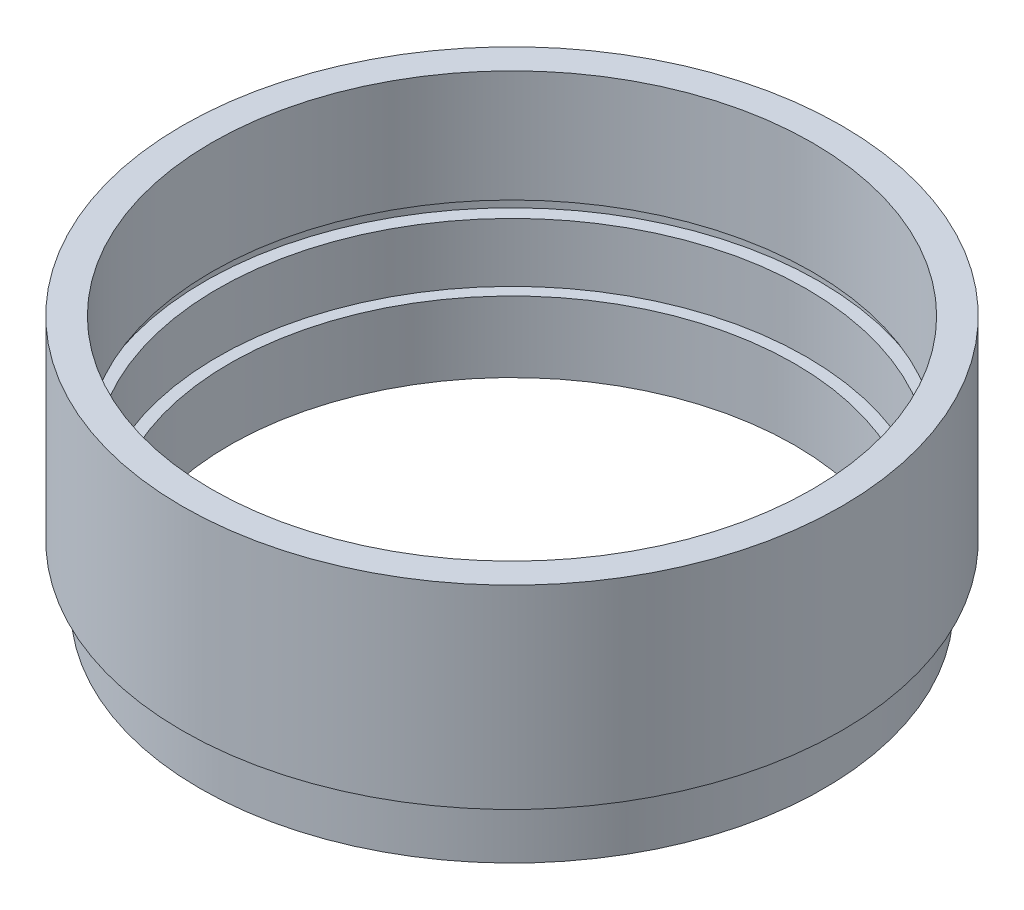
ISO-10303-21;
HEADER;
FILE_DESCRIPTION(('STEP AP214'),'2;1');
FILE_NAME('part.step','',(''),(''),'','','');
FILE_SCHEMA(('AUTOMOTIVE_DESIGN { 1 0 10303 214 1 1 1 1 }'));
ENDSEC;
DATA;
#1=APPLICATION_CONTEXT('core data for automotive mechanical design processes');
#2=APPLICATION_PROTOCOL_DEFINITION('international standard','automotive_design',2000,#1);
#3=PRODUCT_CONTEXT('',#1,'mechanical');
#4=PRODUCT('Part','Part','',(#3));
#5=PRODUCT_RELATED_PRODUCT_CATEGORY('part','',(#4));
#6=PRODUCT_DEFINITION_FORMATION('','',#4);
#7=PRODUCT_DEFINITION_CONTEXT('part definition',#1,'design');
#8=PRODUCT_DEFINITION('design','',#6,#7);
#9=PRODUCT_DEFINITION_SHAPE('','',#8);
#10=(LENGTH_UNIT() NAMED_UNIT(*) SI_UNIT(.MILLI.,.METRE.));
#11=(NAMED_UNIT(*) PLANE_ANGLE_UNIT() SI_UNIT($,.RADIAN.));
#12=(NAMED_UNIT(*) SI_UNIT($,.STERADIAN.) SOLID_ANGLE_UNIT());
#13=UNCERTAINTY_MEASURE_WITH_UNIT(LENGTH_MEASURE(1.E-05),#10,'distance_accuracy_value','');
#14=(GEOMETRIC_REPRESENTATION_CONTEXT(3) GLOBAL_UNCERTAINTY_ASSIGNED_CONTEXT((#13)) GLOBAL_UNIT_ASSIGNED_CONTEXT((#10,
#11,#12)) REPRESENTATION_CONTEXT('',''));
#15=CARTESIAN_POINT('',(0.,0.,0.));
#16=DIRECTION('',(0.,0.,1.));
#17=DIRECTION('',(1.,0.,0.));
#18=AXIS2_PLACEMENT_3D('',#15,#16,#17);
#19=CARTESIAN_POINT('',(0.,0.,0.));
#20=DIRECTION('',(0.,-1.,0.));
#21=DIRECTION('',(0.,0.,-1.));
#22=AXIS2_PLACEMENT_3D('',#19,#20,#21);
#23=CYLINDRICAL_SURFACE('',#22,24.);
#24=CARTESIAN_POINT('',(0.,0.,0.));
#25=DIRECTION('',(0.,-1.,0.));
#26=DIRECTION('',(0.,0.,-1.));
#27=AXIS2_PLACEMENT_3D('',#24,#25,#26);
#28=CIRCLE('',#27,24.);
#29=CARTESIAN_POINT('',(0.,0.,-24.));
#30=VERTEX_POINT('',#29);
#31=EDGE_CURVE('E10',#30,#30,#28,.T.);
#32=ORIENTED_EDGE('',*,*,#31,.T.);
#33=EDGE_LOOP('',(#32));
#34=FACE_BOUND('',#33,.T.);
#35=CARTESIAN_POINT('',(0.,6.,0.));
#36=DIRECTION('',(0.,-1.,0.));
#37=DIRECTION('',(0.,0.,-1.));
#38=AXIS2_PLACEMENT_3D('',#35,#36,#37);
#39=CIRCLE('',#38,24.);
#40=CARTESIAN_POINT('',(0.,6.,-24.));
#41=VERTEX_POINT('',#40);
#42=EDGE_CURVE('E81',#41,#41,#39,.T.);
#43=ORIENTED_EDGE('',*,*,#42,.F.);
#44=EDGE_LOOP('',(#43));
#45=FACE_BOUND('',#44,.T.);
#46=ADVANCED_FACE('F35',(#34,#45),#23,.F.);
#47=CARTESIAN_POINT('',(24.,0.,0.));
#48=DIRECTION('',(0.,-1.,0.));
#49=DIRECTION('',(0.,0.,-1.));
#50=AXIS2_PLACEMENT_3D('',#47,#48,#49);
#51=PLANE('',#50);
#52=CARTESIAN_POINT('',(0.,0.,0.));
#53=DIRECTION('',(0.,-1.,0.));
#54=DIRECTION('',(0.,0.,-1.));
#55=AXIS2_PLACEMENT_3D('',#52,#53,#54);
#56=CIRCLE('',#55,26.5);
#57=CARTESIAN_POINT('',(0.,0.,-26.5));
#58=VERTEX_POINT('',#57);
#59=EDGE_CURVE('E41',#58,#58,#56,.T.);
#60=ORIENTED_EDGE('',*,*,#59,.T.);
#61=EDGE_LOOP('',(#60));
#62=FACE_BOUND('',#61,.T.);
#63=ORIENTED_EDGE('',*,*,#31,.F.);
#64=EDGE_LOOP('',(#63));
#65=FACE_BOUND('',#64,.T.);
#66=ADVANCED_FACE('F89',(#62,#65),#51,.T.);
#67=CARTESIAN_POINT('',(0.,0.,0.));
#68=DIRECTION('',(0.,-1.,0.));
#69=DIRECTION('',(0.,0.,-1.));
#70=AXIS2_PLACEMENT_3D('',#67,#68,#69);
#71=CYLINDRICAL_SURFACE('',#70,26.5);
#72=CARTESIAN_POINT('',(0.,4.,0.));
#73=DIRECTION('',(0.,-1.,0.));
#74=DIRECTION('',(0.,0.,-1.));
#75=AXIS2_PLACEMENT_3D('',#72,#73,#74);
#76=CIRCLE('',#75,26.5);
#77=CARTESIAN_POINT('',(0.,4.,-26.5));
#78=VERTEX_POINT('',#77);
#79=EDGE_CURVE('E45',#78,#78,#76,.T.);
#80=ORIENTED_EDGE('',*,*,#79,.T.);
#81=EDGE_LOOP('',(#80));
#82=FACE_BOUND('',#81,.T.);
#83=ORIENTED_EDGE('',*,*,#59,.F.);
#84=EDGE_LOOP('',(#83));
#85=FACE_BOUND('',#84,.T.);
#86=ADVANCED_FACE('F93',(#82,#85),#71,.T.);
#87=CARTESIAN_POINT('',(26.5,4.,0.));
#88=DIRECTION('',(0.,1.,0.));
#89=DIRECTION('',(0.,0.,1.));
#90=AXIS2_PLACEMENT_3D('',#87,#88,#89);
#91=PLANE('',#90);
#92=CARTESIAN_POINT('',(0.,4.,0.));
#93=DIRECTION('',(0.,-1.,0.));
#94=DIRECTION('',(0.,0.,-1.));
#95=AXIS2_PLACEMENT_3D('',#92,#93,#94);
#96=CIRCLE('',#95,25.5);
#97=CARTESIAN_POINT('',(0.,4.,-25.5));
#98=VERTEX_POINT('',#97);
#99=EDGE_CURVE('E49',#98,#98,#96,.T.);
#100=ORIENTED_EDGE('',*,*,#99,.T.);
#101=EDGE_LOOP('',(#100));
#102=FACE_BOUND('',#101,.T.);
#103=ORIENTED_EDGE('',*,*,#79,.F.);
#104=EDGE_LOOP('',(#103));
#105=FACE_BOUND('',#104,.T.);
#106=ADVANCED_FACE('F97',(#102,#105),#91,.T.);
#107=CARTESIAN_POINT('',(0.,0.,0.));
#108=DIRECTION('',(0.,-1.,0.));
#109=DIRECTION('',(0.,0.,-1.));
#110=AXIS2_PLACEMENT_3D('',#107,#108,#109);
#111=CYLINDRICAL_SURFACE('',#110,25.5);
#112=CARTESIAN_POINT('',(0.,5.,0.));
#113=DIRECTION('',(0.,-1.,0.));
#114=DIRECTION('',(0.,0.,-1.));
#115=AXIS2_PLACEMENT_3D('',#112,#113,#114);
#116=CIRCLE('',#115,25.5);
#117=CARTESIAN_POINT('',(0.,5.,-25.5));
#118=VERTEX_POINT('',#117);
#119=EDGE_CURVE('E54',#118,#118,#116,.T.);
#120=ORIENTED_EDGE('',*,*,#119,.T.);
#121=EDGE_LOOP('',(#120));
#122=FACE_BOUND('',#121,.T.);
#123=ORIENTED_EDGE('',*,*,#99,.F.);
#124=EDGE_LOOP('',(#123));
#125=FACE_BOUND('',#124,.T.);
#126=ADVANCED_FACE('F104',(#122,#125),#111,.T.);
#127=CARTESIAN_POINT('',(25.5,5.,0.));
#128=DIRECTION('',(0.,-1.,0.));
#129=DIRECTION('',(0.,0.,-1.));
#130=AXIS2_PLACEMENT_3D('',#127,#128,#129);
#131=PLANE('',#130);
#132=CARTESIAN_POINT('',(0.,5.,0.));
#133=DIRECTION('',(0.,-1.,0.));
#134=DIRECTION('',(0.,0.,-1.));
#135=AXIS2_PLACEMENT_3D('',#132,#133,#134);
#136=CIRCLE('',#135,28.);
#137=CARTESIAN_POINT('',(0.,5.,-28.));
#138=VERTEX_POINT('',#137);
#139=EDGE_CURVE('E57',#138,#138,#136,.T.);
#140=ORIENTED_EDGE('',*,*,#139,.T.);
#141=EDGE_LOOP('',(#140));
#142=FACE_BOUND('',#141,.T.);
#143=ORIENTED_EDGE('',*,*,#119,.F.);
#144=EDGE_LOOP('',(#143));
#145=FACE_BOUND('',#144,.T.);
#146=ADVANCED_FACE('F108',(#142,#145),#131,.T.);
#147=CARTESIAN_POINT('',(0.,0.,0.));
#148=DIRECTION('',(0.,-1.,0.));
#149=DIRECTION('',(0.,0.,-1.));
#150=AXIS2_PLACEMENT_3D('',#147,#148,#149);
#151=CYLINDRICAL_SURFACE('',#150,28.);
#152=CARTESIAN_POINT('',(0.,21.5,0.));
#153=DIRECTION('',(0.,-1.,0.));
#154=DIRECTION('',(0.,0.,-1.));
#155=AXIS2_PLACEMENT_3D('',#152,#153,#154);
#156=CIRCLE('',#155,28.);
#157=CARTESIAN_POINT('',(0.,21.5,-28.));
#158=VERTEX_POINT('',#157);
#159=EDGE_CURVE('E60',#158,#158,#156,.T.);
#160=ORIENTED_EDGE('',*,*,#159,.T.);
#161=EDGE_LOOP('',(#160));
#162=FACE_BOUND('',#161,.T.);
#163=ORIENTED_EDGE('',*,*,#139,.F.);
#164=EDGE_LOOP('',(#163));
#165=FACE_BOUND('',#164,.T.);
#166=ADVANCED_FACE('F112',(#162,#165),#151,.T.);
#167=CARTESIAN_POINT('',(28.,21.5,0.));
#168=DIRECTION('',(0.,1.,0.));
#169=DIRECTION('',(0.,0.,1.));
#170=AXIS2_PLACEMENT_3D('',#167,#168,#169);
#171=PLANE('',#170);
#172=CARTESIAN_POINT('',(0.,21.5,0.));
#173=DIRECTION('',(0.,-1.,0.));
#174=DIRECTION('',(0.,0.,-1.));
#175=AXIS2_PLACEMENT_3D('',#172,#173,#174);
#176=CIRCLE('',#175,25.5);
#177=CARTESIAN_POINT('',(0.,21.5,-25.5));
#178=VERTEX_POINT('',#177);
#179=EDGE_CURVE('E63',#178,#178,#176,.T.);
#180=ORIENTED_EDGE('',*,*,#179,.T.);
#181=EDGE_LOOP('',(#180));
#182=FACE_BOUND('',#181,.T.);
#183=ORIENTED_EDGE('',*,*,#159,.F.);
#184=EDGE_LOOP('',(#183));
#185=FACE_BOUND('',#184,.T.);
#186=ADVANCED_FACE('F116',(#182,#185),#171,.T.);
#187=CARTESIAN_POINT('',(0.,0.,0.));
#188=DIRECTION('',(0.,-1.,0.));
#189=DIRECTION('',(0.,0.,-1.));
#190=AXIS2_PLACEMENT_3D('',#187,#188,#189);
#191=CYLINDRICAL_SURFACE('',#190,25.5);
#192=CARTESIAN_POINT('',(0.,12.,0.));
#193=DIRECTION('',(0.,-1.,0.));
#194=DIRECTION('',(0.,0.,-1.));
#195=AXIS2_PLACEMENT_3D('',#192,#193,#194);
#196=CIRCLE('',#195,25.5);
#197=CARTESIAN_POINT('',(0.,12.,-25.5));
#198=VERTEX_POINT('',#197);
#199=EDGE_CURVE('E66',#198,#198,#196,.T.);
#200=ORIENTED_EDGE('',*,*,#199,.T.);
#201=EDGE_LOOP('',(#200));
#202=FACE_BOUND('',#201,.T.);
#203=ORIENTED_EDGE('',*,*,#179,.F.);
#204=EDGE_LOOP('',(#203));
#205=FACE_BOUND('',#204,.T.);
#206=ADVANCED_FACE('F120',(#202,#205),#191,.F.);
#207=CARTESIAN_POINT('',(25.5,12.,0.));
#208=DIRECTION('',(0.,-1.,0.));
#209=DIRECTION('',(0.,0.,-1.));
#210=AXIS2_PLACEMENT_3D('',#207,#208,#209);
#211=PLANE('',#210);
#212=CARTESIAN_POINT('',(0.,12.,0.));
#213=DIRECTION('',(0.,-1.,0.));
#214=DIRECTION('',(0.,0.,-1.));
#215=AXIS2_PLACEMENT_3D('',#212,#213,#214);
#216=CIRCLE('',#215,26.1);
#217=CARTESIAN_POINT('',(0.,12.,-26.1));
#218=VERTEX_POINT('',#217);
#219=EDGE_CURVE('E69',#218,#218,#216,.T.);
#220=ORIENTED_EDGE('',*,*,#219,.T.);
#221=EDGE_LOOP('',(#220));
#222=FACE_BOUND('',#221,.T.);
#223=ORIENTED_EDGE('',*,*,#199,.F.);
#224=EDGE_LOOP('',(#223));
#225=FACE_BOUND('',#224,.T.);
#226=ADVANCED_FACE('F124',(#222,#225),#211,.T.);
#227=CARTESIAN_POINT('',(0.,0.,0.));
#228=DIRECTION('',(0.,-1.,0.));
#229=DIRECTION('',(0.,0.,-1.));
#230=AXIS2_PLACEMENT_3D('',#227,#228,#229);
#231=CYLINDRICAL_SURFACE('',#230,26.1);
#232=CARTESIAN_POINT('',(0.,11.,0.));
#233=DIRECTION('',(0.,-1.,0.));
#234=DIRECTION('',(0.,0.,-1.));
#235=AXIS2_PLACEMENT_3D('',#232,#233,#234);
#236=CIRCLE('',#235,26.1);
#237=CARTESIAN_POINT('',(0.,11.,-26.1));
#238=VERTEX_POINT('',#237);
#239=EDGE_CURVE('E72',#238,#238,#236,.T.);
#240=ORIENTED_EDGE('',*,*,#239,.T.);
#241=EDGE_LOOP('',(#240));
#242=FACE_BOUND('',#241,.T.);
#243=ORIENTED_EDGE('',*,*,#219,.F.);
#244=EDGE_LOOP('',(#243));
#245=FACE_BOUND('',#244,.T.);
#246=ADVANCED_FACE('F128',(#242,#245),#231,.F.);
#247=CARTESIAN_POINT('',(26.1,11.,0.));
#248=DIRECTION('',(0.,1.,0.));
#249=DIRECTION('',(0.,0.,1.));
#250=AXIS2_PLACEMENT_3D('',#247,#248,#249);
#251=PLANE('',#250);
#252=CARTESIAN_POINT('',(0.,11.,0.));
#253=DIRECTION('',(0.,-1.,0.));
#254=DIRECTION('',(0.,0.,-1.));
#255=AXIS2_PLACEMENT_3D('',#252,#253,#254);
#256=CIRCLE('',#255,25.);
#257=CARTESIAN_POINT('',(0.,11.,-25.));
#258=VERTEX_POINT('',#257);
#259=EDGE_CURVE('E75',#258,#258,#256,.T.);
#260=ORIENTED_EDGE('',*,*,#259,.T.);
#261=EDGE_LOOP('',(#260));
#262=FACE_BOUND('',#261,.T.);
#263=ORIENTED_EDGE('',*,*,#239,.F.);
#264=EDGE_LOOP('',(#263));
#265=FACE_BOUND('',#264,.T.);
#266=ADVANCED_FACE('F132',(#262,#265),#251,.T.);
#267=CARTESIAN_POINT('',(0.,0.,0.));
#268=DIRECTION('',(0.,-1.,0.));
#269=DIRECTION('',(0.,0.,-1.));
#270=AXIS2_PLACEMENT_3D('',#267,#268,#269);
#271=CYLINDRICAL_SURFACE('',#270,25.);
#272=CARTESIAN_POINT('',(0.,6.,0.));
#273=DIRECTION('',(0.,-1.,0.));
#274=DIRECTION('',(0.,0.,-1.));
#275=AXIS2_PLACEMENT_3D('',#272,#273,#274);
#276=CIRCLE('',#275,25.);
#277=CARTESIAN_POINT('',(0.,6.,-25.));
#278=VERTEX_POINT('',#277);
#279=EDGE_CURVE('E78',#278,#278,#276,.T.);
#280=ORIENTED_EDGE('',*,*,#279,.T.);
#281=EDGE_LOOP('',(#280));
#282=FACE_BOUND('',#281,.T.);
#283=ORIENTED_EDGE('',*,*,#259,.F.);
#284=EDGE_LOOP('',(#283));
#285=FACE_BOUND('',#284,.T.);
#286=ADVANCED_FACE('F136',(#282,#285),#271,.F.);
#287=CARTESIAN_POINT('',(25.,6.,0.));
#288=DIRECTION('',(0.,1.,0.));
#289=DIRECTION('',(0.,0.,1.));
#290=AXIS2_PLACEMENT_3D('',#287,#288,#289);
#291=PLANE('',#290);
#292=ORIENTED_EDGE('',*,*,#42,.T.);
#293=EDGE_LOOP('',(#292));
#294=FACE_BOUND('',#293,.T.);
#295=ORIENTED_EDGE('',*,*,#279,.F.);
#296=EDGE_LOOP('',(#295));
#297=FACE_BOUND('',#296,.T.);
#298=ADVANCED_FACE('F85',(#294,#297),#291,.T.);
#299=CLOSED_SHELL('',(#46,#66,#86,#106,#126,#146,#166,#186,#206,#226,#246,#266,#286,#298));
#300=MANIFOLD_SOLID_BREP('B2',#299);
#301=ADVANCED_BREP_SHAPE_REPRESENTATION('',(#18,#300),#14);
#302=SHAPE_DEFINITION_REPRESENTATION(#9,#301);
ENDSEC;
END-ISO-10303-21;
